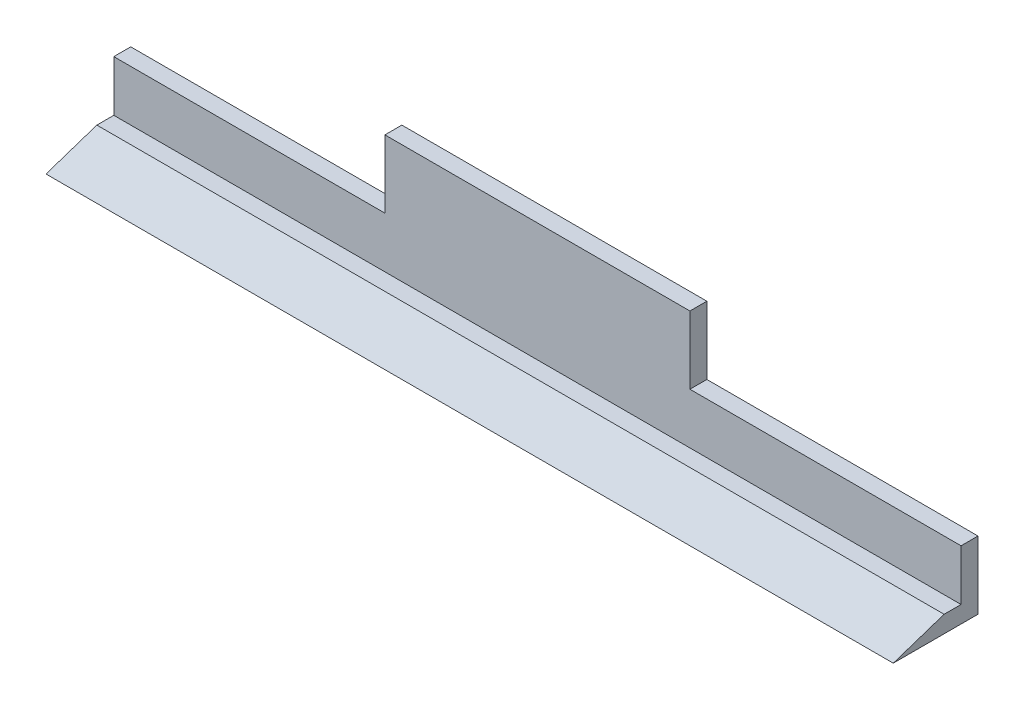
ISO-10303-21;
HEADER;
FILE_DESCRIPTION(('STEP AP214'),'2;1');
FILE_NAME('part.step','',(''),(''),'','','');
FILE_SCHEMA(('AUTOMOTIVE_DESIGN { 1 0 10303 214 1 1 1 1 }'));
ENDSEC;
DATA;
#1=APPLICATION_CONTEXT('core data for automotive mechanical design processes');
#2=APPLICATION_PROTOCOL_DEFINITION('international standard','automotive_design',2000,#1);
#3=PRODUCT_CONTEXT('',#1,'mechanical');
#4=PRODUCT('Part','Part','',(#3));
#5=PRODUCT_RELATED_PRODUCT_CATEGORY('part','',(#4));
#6=PRODUCT_DEFINITION_FORMATION('','',#4);
#7=PRODUCT_DEFINITION_CONTEXT('part definition',#1,'design');
#8=PRODUCT_DEFINITION('design','',#6,#7);
#9=PRODUCT_DEFINITION_SHAPE('','',#8);
#10=(LENGTH_UNIT() NAMED_UNIT(*) SI_UNIT(.MILLI.,.METRE.));
#11=(NAMED_UNIT(*) PLANE_ANGLE_UNIT() SI_UNIT($,.RADIAN.));
#12=(NAMED_UNIT(*) SI_UNIT($,.STERADIAN.) SOLID_ANGLE_UNIT());
#13=UNCERTAINTY_MEASURE_WITH_UNIT(LENGTH_MEASURE(1.E-05),#10,'distance_accuracy_value','');
#14=(GEOMETRIC_REPRESENTATION_CONTEXT(3) GLOBAL_UNCERTAINTY_ASSIGNED_CONTEXT((#13)) GLOBAL_UNIT_ASSIGNED_CONTEXT((#10,
#11,#12)) REPRESENTATION_CONTEXT('',''));
#15=CARTESIAN_POINT('',(0.,0.,0.));
#16=DIRECTION('',(0.,0.,1.));
#17=DIRECTION('',(1.,0.,0.));
#18=AXIS2_PLACEMENT_3D('',#15,#16,#17);
#19=CARTESIAN_POINT('',(0.,0.,5.));
#20=DIRECTION('',(0.,0.,1.));
#21=DIRECTION('',(1.,0.,0.));
#22=AXIS2_PLACEMENT_3D('',#19,#20,#21);
#23=PLANE('',#22);
#24=DIRECTION('',(0.,1.,0.));
#25=VECTOR('',#24,1.);
#26=CARTESIAN_POINT('',(-250.,0.,5.));
#27=LINE('',#26,#25);
#28=CARTESIAN_POINT('',(-250.,5.,5.));
#29=VERTEX_POINT('',#28);
#30=CARTESIAN_POINT('',(-250.,20.,5.));
#31=VERTEX_POINT('',#30);
#32=EDGE_CURVE('E169',#29,#31,#27,.T.);
#33=ORIENTED_EDGE('',*,*,#32,.F.);
#34=DIRECTION('',(1.,0.,0.));
#35=VECTOR('',#34,1.);
#36=CARTESIAN_POINT('',(-250.,5.,5.));
#37=LINE('',#36,#35);
#38=CARTESIAN_POINT('',(0.,5.,5.));
#39=VERTEX_POINT('',#38);
#40=EDGE_CURVE('E144',#29,#39,#37,.T.);
#41=ORIENTED_EDGE('',*,*,#40,.T.);
#42=DIRECTION('',(0.,1.,0.));
#43=VECTOR('',#42,1.);
#44=CARTESIAN_POINT('',(0.,0.,5.));
#45=LINE('',#44,#43);
#46=CARTESIAN_POINT('',(0.,20.,5.));
#47=VERTEX_POINT('',#46);
#48=EDGE_CURVE('E116',#39,#47,#45,.T.);
#49=ORIENTED_EDGE('',*,*,#48,.T.);
#50=DIRECTION('',(-1.,0.,0.));
#51=VECTOR('',#50,1.);
#52=CARTESIAN_POINT('',(0.,20.,5.));
#53=LINE('',#52,#51);
#54=CARTESIAN_POINT('',(-80.,20.,5.));
#55=VERTEX_POINT('',#54);
#56=EDGE_CURVE('E108',#47,#55,#53,.T.);
#57=ORIENTED_EDGE('',*,*,#56,.T.);
#58=DIRECTION('',(0.,1.,0.));
#59=VECTOR('',#58,1.);
#60=CARTESIAN_POINT('',(-80.,0.,5.));
#61=LINE('',#60,#59);
#62=CARTESIAN_POINT('',(-80.,40.,5.));
#63=VERTEX_POINT('',#62);
#64=EDGE_CURVE('E113',#55,#63,#61,.T.);
#65=ORIENTED_EDGE('',*,*,#64,.T.);
#66=DIRECTION('',(1.,0.,0.));
#67=VECTOR('',#66,1.);
#68=CARTESIAN_POINT('',(0.,40.,5.));
#69=LINE('',#68,#67);
#70=CARTESIAN_POINT('',(-170.,40.,5.));
#71=VERTEX_POINT('',#70);
#72=EDGE_CURVE('E134',#71,#63,#69,.T.);
#73=ORIENTED_EDGE('',*,*,#72,.F.);
#74=DIRECTION('',(0.,1.,0.));
#75=VECTOR('',#74,1.);
#76=CARTESIAN_POINT('',(-170.,0.,5.));
#77=LINE('',#76,#75);
#78=CARTESIAN_POINT('',(-170.,20.,5.));
#79=VERTEX_POINT('',#78);
#80=EDGE_CURVE('E160',#79,#71,#77,.T.);
#81=ORIENTED_EDGE('',*,*,#80,.F.);
#82=EDGE_CURVE('E121',#79,#31,#53,.T.);
#83=ORIENTED_EDGE('',*,*,#82,.T.);
#84=EDGE_LOOP('',(#33,#41,#49,#57,#65,#73,#81,#83));
#85=FACE_BOUND('',#84,.T.);
#86=ADVANCED_FACE('F35',(#85),#23,.T.);
#87=CARTESIAN_POINT('',(-170.,0.,5.));
#88=DIRECTION('',(-1.,0.,0.));
#89=DIRECTION('',(0.,0.,1.));
#90=AXIS2_PLACEMENT_3D('',#87,#88,#89);
#91=PLANE('',#90);
#92=DIRECTION('',(0.,1.,0.));
#93=VECTOR('',#92,1.);
#94=CARTESIAN_POINT('',(-170.,0.,0.));
#95=LINE('',#94,#93);
#96=CARTESIAN_POINT('',(-170.,20.,0.));
#97=VERTEX_POINT('',#96);
#98=CARTESIAN_POINT('',(-170.,40.,0.));
#99=VERTEX_POINT('',#98);
#100=EDGE_CURVE('E141',#97,#99,#95,.T.);
#101=ORIENTED_EDGE('',*,*,#100,.F.);
#102=DIRECTION('',(0.,0.,-1.));
#103=VECTOR('',#102,1.);
#104=CARTESIAN_POINT('',(-170.,20.,5.));
#105=LINE('',#104,#103);
#106=EDGE_CURVE('E11',#79,#97,#105,.T.);
#107=ORIENTED_EDGE('',*,*,#106,.F.);
#108=ORIENTED_EDGE('',*,*,#80,.T.);
#109=DIRECTION('',(0.,0.,-1.));
#110=VECTOR('',#109,1.);
#111=CARTESIAN_POINT('',(-170.,40.,5.));
#112=LINE('',#111,#110);
#113=EDGE_CURVE('E61',#71,#99,#112,.T.);
#114=ORIENTED_EDGE('',*,*,#113,.T.);
#115=EDGE_LOOP('',(#101,#107,#108,#114));
#116=FACE_BOUND('',#115,.T.);
#117=ADVANCED_FACE('F37',(#116),#91,.T.);
#118=CARTESIAN_POINT('',(0.,20.,5.));
#119=DIRECTION('',(0.,-1.,0.));
#120=DIRECTION('',(1.,0.,0.));
#121=AXIS2_PLACEMENT_3D('',#118,#119,#120);
#122=PLANE('',#121);
#123=DIRECTION('',(-1.,0.,0.));
#124=VECTOR('',#123,1.);
#125=CARTESIAN_POINT('',(0.,20.,0.));
#126=LINE('',#125,#124);
#127=CARTESIAN_POINT('',(-250.,20.,0.));
#128=VERTEX_POINT('',#127);
#129=EDGE_CURVE('E143',#97,#128,#126,.T.);
#130=ORIENTED_EDGE('',*,*,#129,.T.);
#131=DIRECTION('',(0.,0.,-1.));
#132=VECTOR('',#131,1.);
#133=CARTESIAN_POINT('',(-250.,20.,5.));
#134=LINE('',#133,#132);
#135=EDGE_CURVE('E44',#31,#128,#134,.T.);
#136=ORIENTED_EDGE('',*,*,#135,.F.);
#137=ORIENTED_EDGE('',*,*,#82,.F.);
#138=ORIENTED_EDGE('',*,*,#106,.T.);
#139=EDGE_LOOP('',(#130,#136,#137,#138));
#140=FACE_BOUND('',#139,.T.);
#141=ADVANCED_FACE('F215',(#140),#122,.F.);
#142=CARTESIAN_POINT('',(-250.,0.,5.));
#143=DIRECTION('',(-1.,0.,0.));
#144=DIRECTION('',(0.,0.,1.));
#145=AXIS2_PLACEMENT_3D('',#142,#143,#144);
#146=PLANE('',#145);
#147=DIRECTION('',(0.,1.,0.));
#148=VECTOR('',#147,1.);
#149=CARTESIAN_POINT('',(-250.,0.,0.));
#150=LINE('',#149,#148);
#151=CARTESIAN_POINT('',(-250.,0.,0.));
#152=VERTEX_POINT('',#151);
#153=EDGE_CURVE('E147',#152,#128,#150,.T.);
#154=ORIENTED_EDGE('',*,*,#153,.F.);
#155=DIRECTION('',(0.,0.,-1.));
#156=VECTOR('',#155,1.);
#157=CARTESIAN_POINT('',(-250.,0.,5.));
#158=LINE('',#157,#156);
#159=CARTESIAN_POINT('',(-250.,0.,25.));
#160=VERTEX_POINT('',#159);
#161=EDGE_CURVE('E166',#160,#152,#158,.T.);
#162=ORIENTED_EDGE('',*,*,#161,.F.);
#163=DIRECTION('',(0.,0.316227766016838,-0.948683298050514));
#164=VECTOR('',#163,1.);
#165=CARTESIAN_POINT('',(-250.,7.5,2.5));
#166=LINE('',#165,#164);
#167=CARTESIAN_POINT('',(-250.,5.,10.));
#168=VERTEX_POINT('',#167);
#169=EDGE_CURVE('E179',#160,#168,#166,.T.);
#170=ORIENTED_EDGE('',*,*,#169,.T.);
#171=DIRECTION('',(0.,0.,-1.));
#172=VECTOR('',#171,1.);
#173=CARTESIAN_POINT('',(-250.,5.,0.));
#174=LINE('',#173,#172);
#175=EDGE_CURVE('E189',#168,#29,#174,.T.);
#176=ORIENTED_EDGE('',*,*,#175,.T.);
#177=ORIENTED_EDGE('',*,*,#32,.T.);
#178=ORIENTED_EDGE('',*,*,#135,.T.);
#179=EDGE_LOOP('',(#154,#162,#170,#176,#177,#178));
#180=FACE_BOUND('',#179,.T.);
#181=ADVANCED_FACE('F220',(#180),#146,.T.);
#182=CARTESIAN_POINT('',(0.,0.,5.));
#183=DIRECTION('',(0.,-1.,0.));
#184=DIRECTION('',(1.,0.,0.));
#185=AXIS2_PLACEMENT_3D('',#182,#183,#184);
#186=PLANE('',#185);
#187=DIRECTION('',(-1.,0.,0.));
#188=VECTOR('',#187,1.);
#189=CARTESIAN_POINT('',(0.,0.,0.));
#190=LINE('',#189,#188);
#191=CARTESIAN_POINT('',(0.,0.,0.));
#192=VERTEX_POINT('',#191);
#193=EDGE_CURVE('E150',#192,#152,#190,.T.);
#194=ORIENTED_EDGE('',*,*,#193,.F.);
#195=DIRECTION('',(0.,0.,-1.));
#196=VECTOR('',#195,1.);
#197=CARTESIAN_POINT('',(0.,0.,5.));
#198=LINE('',#197,#196);
#199=CARTESIAN_POINT('',(0.,0.,25.));
#200=VERTEX_POINT('',#199);
#201=EDGE_CURVE('E164',#200,#192,#198,.T.);
#202=ORIENTED_EDGE('',*,*,#201,.F.);
#203=DIRECTION('',(1.,0.,0.));
#204=VECTOR('',#203,1.);
#205=CARTESIAN_POINT('',(-250.,0.,25.));
#206=LINE('',#205,#204);
#207=EDGE_CURVE('E178',#160,#200,#206,.T.);
#208=ORIENTED_EDGE('',*,*,#207,.F.);
#209=ORIENTED_EDGE('',*,*,#161,.T.);
#210=EDGE_LOOP('',(#194,#202,#208,#209));
#211=FACE_BOUND('',#210,.T.);
#212=ADVANCED_FACE('F238',(#211),#186,.T.);
#213=CARTESIAN_POINT('',(0.,0.,5.));
#214=DIRECTION('',(-1.,0.,0.));
#215=DIRECTION('',(0.,0.,1.));
#216=AXIS2_PLACEMENT_3D('',#213,#214,#215);
#217=PLANE('',#216);
#218=DIRECTION('',(0.,1.,0.));
#219=VECTOR('',#218,1.);
#220=CARTESIAN_POINT('',(0.,0.,0.));
#221=LINE('',#220,#219);
#222=CARTESIAN_POINT('',(0.,20.,0.));
#223=VERTEX_POINT('',#222);
#224=EDGE_CURVE('E153',#192,#223,#221,.T.);
#225=ORIENTED_EDGE('',*,*,#224,.T.);
#226=DIRECTION('',(0.,0.,-1.));
#227=VECTOR('',#226,1.);
#228=CARTESIAN_POINT('',(0.,20.,5.));
#229=LINE('',#228,#227);
#230=EDGE_CURVE('E130',#47,#223,#229,.T.);
#231=ORIENTED_EDGE('',*,*,#230,.F.);
#232=ORIENTED_EDGE('',*,*,#48,.F.);
#233=DIRECTION('',(0.,0.,-1.));
#234=VECTOR('',#233,1.);
#235=CARTESIAN_POINT('',(0.,5.,0.));
#236=LINE('',#235,#234);
#237=CARTESIAN_POINT('',(0.,5.,10.));
#238=VERTEX_POINT('',#237);
#239=EDGE_CURVE('E52',#238,#39,#236,.T.);
#240=ORIENTED_EDGE('',*,*,#239,.F.);
#241=DIRECTION('',(0.,0.316227766016838,-0.948683298050514));
#242=VECTOR('',#241,1.);
#243=CARTESIAN_POINT('',(0.,7.5,2.5));
#244=LINE('',#243,#242);
#245=EDGE_CURVE('E184',#200,#238,#244,.T.);
#246=ORIENTED_EDGE('',*,*,#245,.F.);
#247=ORIENTED_EDGE('',*,*,#201,.T.);
#248=EDGE_LOOP('',(#225,#231,#232,#240,#246,#247));
#249=FACE_BOUND('',#248,.T.);
#250=ADVANCED_FACE('F205',(#249),#217,.F.);
#251=CARTESIAN_POINT('',(-80.,20.,0.));
#252=VERTEX_POINT('',#251);
#253=EDGE_CURVE('E126',#223,#252,#126,.T.);
#254=ORIENTED_EDGE('',*,*,#253,.T.);
#255=DIRECTION('',(0.,0.,-1.));
#256=VECTOR('',#255,1.);
#257=CARTESIAN_POINT('',(-80.,20.,5.));
#258=LINE('',#257,#256);
#259=EDGE_CURVE('E123',#55,#252,#258,.T.);
#260=ORIENTED_EDGE('',*,*,#259,.F.);
#261=ORIENTED_EDGE('',*,*,#56,.F.);
#262=ORIENTED_EDGE('',*,*,#230,.T.);
#263=EDGE_LOOP('',(#254,#260,#261,#262));
#264=FACE_BOUND('',#263,.T.);
#265=ADVANCED_FACE('F124',(#264),#122,.F.);
#266=CARTESIAN_POINT('',(-80.,0.,5.));
#267=DIRECTION('',(-1.,0.,0.));
#268=DIRECTION('',(0.,0.,1.));
#269=AXIS2_PLACEMENT_3D('',#266,#267,#268);
#270=PLANE('',#269);
#271=DIRECTION('',(0.,1.,0.));
#272=VECTOR('',#271,1.);
#273=CARTESIAN_POINT('',(-80.,0.,0.));
#274=LINE('',#273,#272);
#275=CARTESIAN_POINT('',(-80.,40.,0.));
#276=VERTEX_POINT('',#275);
#277=EDGE_CURVE('E155',#252,#276,#274,.T.);
#278=ORIENTED_EDGE('',*,*,#277,.T.);
#279=DIRECTION('',(0.,0.,-1.));
#280=VECTOR('',#279,1.);
#281=CARTESIAN_POINT('',(-80.,40.,5.));
#282=LINE('',#281,#280);
#283=EDGE_CURVE('E131',#63,#276,#282,.T.);
#284=ORIENTED_EDGE('',*,*,#283,.F.);
#285=ORIENTED_EDGE('',*,*,#64,.F.);
#286=ORIENTED_EDGE('',*,*,#259,.T.);
#287=EDGE_LOOP('',(#278,#284,#285,#286));
#288=FACE_BOUND('',#287,.T.);
#289=ADVANCED_FACE('F133',(#288),#270,.F.);
#290=CARTESIAN_POINT('',(0.,40.,5.));
#291=DIRECTION('',(0.,1.,0.));
#292=DIRECTION('',(0.,0.,1.));
#293=AXIS2_PLACEMENT_3D('',#290,#291,#292);
#294=PLANE('',#293);
#295=DIRECTION('',(1.,0.,0.));
#296=VECTOR('',#295,1.);
#297=CARTESIAN_POINT('',(0.,40.,0.));
#298=LINE('',#297,#296);
#299=EDGE_CURVE('E157',#99,#276,#298,.T.);
#300=ORIENTED_EDGE('',*,*,#299,.F.);
#301=ORIENTED_EDGE('',*,*,#113,.F.);
#302=ORIENTED_EDGE('',*,*,#72,.T.);
#303=ORIENTED_EDGE('',*,*,#283,.T.);
#304=EDGE_LOOP('',(#300,#301,#302,#303));
#305=FACE_BOUND('',#304,.T.);
#306=ADVANCED_FACE('F211',(#305),#294,.T.);
#307=CARTESIAN_POINT('',(0.,0.,0.));
#308=DIRECTION('',(0.,0.,1.));
#309=DIRECTION('',(1.,0.,0.));
#310=AXIS2_PLACEMENT_3D('',#307,#308,#309);
#311=PLANE('',#310);
#312=ORIENTED_EDGE('',*,*,#100,.T.);
#313=ORIENTED_EDGE('',*,*,#299,.T.);
#314=ORIENTED_EDGE('',*,*,#277,.F.);
#315=ORIENTED_EDGE('',*,*,#253,.F.);
#316=ORIENTED_EDGE('',*,*,#224,.F.);
#317=ORIENTED_EDGE('',*,*,#193,.T.);
#318=ORIENTED_EDGE('',*,*,#153,.T.);
#319=ORIENTED_EDGE('',*,*,#129,.F.);
#320=EDGE_LOOP('',(#312,#313,#314,#315,#316,#317,#318,#319));
#321=FACE_BOUND('',#320,.T.);
#322=ADVANCED_FACE('F208',(#321),#311,.F.);
#323=CARTESIAN_POINT('',(-250.,5.,0.));
#324=DIRECTION('',(0.,-1.,0.));
#325=DIRECTION('',(0.,0.,-1.));
#326=AXIS2_PLACEMENT_3D('',#323,#324,#325);
#327=PLANE('',#326);
#328=ORIENTED_EDGE('',*,*,#239,.T.);
#329=ORIENTED_EDGE('',*,*,#40,.F.);
#330=ORIENTED_EDGE('',*,*,#175,.F.);
#331=DIRECTION('',(1.,0.,0.));
#332=VECTOR('',#331,1.);
#333=CARTESIAN_POINT('',(-250.,5.,10.));
#334=LINE('',#333,#332);
#335=EDGE_CURVE('E176',#168,#238,#334,.T.);
#336=ORIENTED_EDGE('',*,*,#335,.T.);
#337=EDGE_LOOP('',(#328,#329,#330,#336));
#338=FACE_BOUND('',#337,.T.);
#339=ADVANCED_FACE('F204',(#338),#327,.F.);
#340=CARTESIAN_POINT('',(-250.,7.5,2.5));
#341=DIRECTION('',(0.,-0.948683298050514,-0.316227766016838));
#342=DIRECTION('',(0.,0.316227766016838,-0.948683298050514));
#343=AXIS2_PLACEMENT_3D('',#340,#341,#342);
#344=PLANE('',#343);
#345=ORIENTED_EDGE('',*,*,#245,.T.);
#346=ORIENTED_EDGE('',*,*,#335,.F.);
#347=ORIENTED_EDGE('',*,*,#169,.F.);
#348=ORIENTED_EDGE('',*,*,#207,.T.);
#349=EDGE_LOOP('',(#345,#346,#347,#348));
#350=FACE_BOUND('',#349,.T.);
#351=ADVANCED_FACE('F199',(#350),#344,.F.);
#352=CLOSED_SHELL('',(#86,#117,#141,#181,#212,#250,#265,#289,#306,#322,#339,#351));
#353=MANIFOLD_SOLID_BREP('B2',#352);
#354=ADVANCED_BREP_SHAPE_REPRESENTATION('',(#18,#353),#14);
#355=SHAPE_DEFINITION_REPRESENTATION(#9,#354);
ENDSEC;
END-ISO-10303-21;
